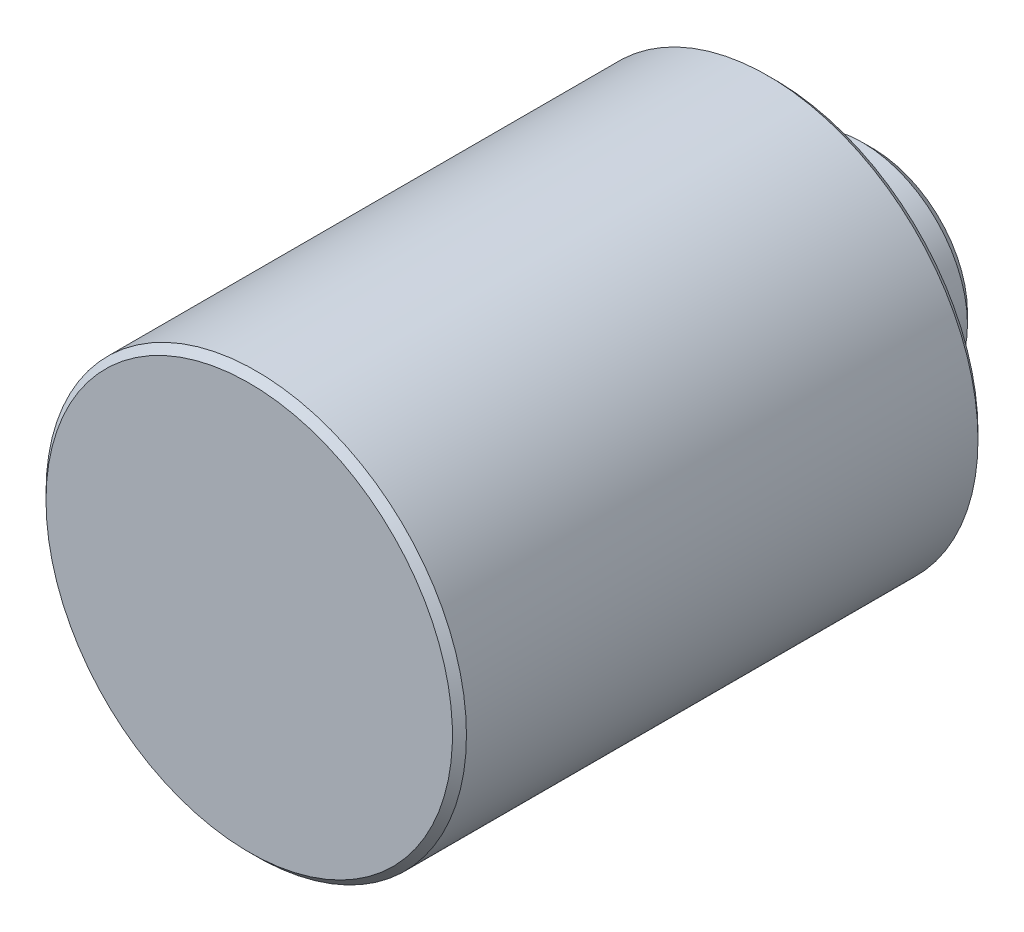
ISO-10303-21;
HEADER;
FILE_DESCRIPTION(('STEP AP214'),'2;1');
FILE_NAME('part.step','',(''),(''),'','','');
FILE_SCHEMA(('AUTOMOTIVE_DESIGN { 1 0 10303 214 1 1 1 1 }'));
ENDSEC;
DATA;
#1=APPLICATION_CONTEXT('core data for automotive mechanical design processes');
#2=APPLICATION_PROTOCOL_DEFINITION('international standard','automotive_design',2000,#1);
#3=PRODUCT_CONTEXT('',#1,'mechanical');
#4=PRODUCT('Part','Part','',(#3));
#5=PRODUCT_RELATED_PRODUCT_CATEGORY('part','',(#4));
#6=PRODUCT_DEFINITION_FORMATION('','',#4);
#7=PRODUCT_DEFINITION_CONTEXT('part definition',#1,'design');
#8=PRODUCT_DEFINITION('design','',#6,#7);
#9=PRODUCT_DEFINITION_SHAPE('','',#8);
#10=(LENGTH_UNIT() NAMED_UNIT(*) SI_UNIT(.MILLI.,.METRE.));
#11=(NAMED_UNIT(*) PLANE_ANGLE_UNIT() SI_UNIT($,.RADIAN.));
#12=(NAMED_UNIT(*) SI_UNIT($,.STERADIAN.) SOLID_ANGLE_UNIT());
#13=UNCERTAINTY_MEASURE_WITH_UNIT(LENGTH_MEASURE(1.E-05),#10,'distance_accuracy_value','');
#14=(GEOMETRIC_REPRESENTATION_CONTEXT(3) GLOBAL_UNCERTAINTY_ASSIGNED_CONTEXT((#13)) GLOBAL_UNIT_ASSIGNED_CONTEXT((#10,
#11,#12)) REPRESENTATION_CONTEXT('',''));
#15=CARTESIAN_POINT('',(0.,0.,0.));
#16=DIRECTION('',(0.,0.,1.));
#17=DIRECTION('',(1.,0.,0.));
#18=AXIS2_PLACEMENT_3D('',#15,#16,#17);
#19=CARTESIAN_POINT('',(0.,0.,6.20000000003529));
#20=DIRECTION('',(0.,0.,-1.));
#21=DIRECTION('',(-1.,0.,0.));
#22=AXIS2_PLACEMENT_3D('',#19,#20,#21);
#23=CONICAL_SURFACE('',#22,1.62100000005694,1.02974425868292);
#24=CARTESIAN_POINT('',(1.13686837721616E-10,0.,7.17399506345373));
#25=VERTEX_POINT('',#24);
#26=VERTEX_LOOP('',#25);
#27=FACE_BOUND('',#26,.T.);
#28=CARTESIAN_POINT('',(0.,0.,6.2));
#29=DIRECTION('',(0.,0.,-1.));
#30=DIRECTION('',(-1.,0.,0.));
#31=AXIS2_PLACEMENT_3D('',#28,#29,#30);
#32=CIRCLE('',#31,1.621);
#33=CARTESIAN_POINT('',(-1.621,0.,6.2));
#34=VERTEX_POINT('',#33);
#35=EDGE_CURVE('E33',#34,#34,#32,.T.);
#36=ORIENTED_EDGE('',*,*,#35,.T.);
#37=EDGE_LOOP('',(#36));
#38=FACE_BOUND('',#37,.T.);
#39=ADVANCED_FACE('F17',(#27,#38),#23,.F.);
#40=CARTESIAN_POINT('',(0.,0.,1.7));
#41=DIRECTION('',(0.,0.,-1.));
#42=DIRECTION('',(-1.,0.,0.));
#43=AXIS2_PLACEMENT_3D('',#40,#41,#42);
#44=CYLINDRICAL_SURFACE('',#43,1.621);
#45=ORIENTED_EDGE('',*,*,#35,.F.);
#46=EDGE_LOOP('',(#45));
#47=FACE_BOUND('',#46,.T.);
#48=CARTESIAN_POINT('',(0.,0.,-2.8));
#49=DIRECTION('',(0.,0.,-1.));
#50=DIRECTION('',(-1.,0.,0.));
#51=AXIS2_PLACEMENT_3D('',#48,#49,#50);
#52=CIRCLE('',#51,1.621);
#53=CARTESIAN_POINT('',(-1.621,0.,-2.8));
#54=VERTEX_POINT('',#53);
#55=EDGE_CURVE('E20',#54,#54,#52,.T.);
#56=ORIENTED_EDGE('',*,*,#55,.T.);
#57=EDGE_LOOP('',(#56));
#58=FACE_BOUND('',#57,.T.);
#59=ADVANCED_FACE('F30',(#47,#58),#44,.F.);
#60=CARTESIAN_POINT('',(0.,0.,-2.8));
#61=DIRECTION('',(0.,0.,1.));
#62=DIRECTION('',(1.,0.,0.));
#63=AXIS2_PLACEMENT_3D('',#60,#61,#62);
#64=PLANE('',#63);
#65=ORIENTED_EDGE('',*,*,#55,.F.);
#66=EDGE_LOOP('',(#65));
#67=FACE_BOUND('',#66,.T.);
#68=CARTESIAN_POINT('',(0.,0.,-2.79999999997926));
#69=DIRECTION('',(0.,0.,1.));
#70=DIRECTION('',(1.,0.,0.));
#71=AXIS2_PLACEMENT_3D('',#68,#69,#70);
#72=CIRCLE('',#71,2.70000000000437);
#73=CARTESIAN_POINT('',(2.70000000000437,0.,-2.79999999997926));
#74=VERTEX_POINT('',#73);
#75=EDGE_CURVE('E37',#74,#74,#72,.T.);
#76=ORIENTED_EDGE('',*,*,#75,.F.);
#77=EDGE_LOOP('',(#76));
#78=FACE_BOUND('',#77,.T.);
#79=ADVANCED_FACE('F60',(#67,#78),#64,.F.);
#80=CARTESIAN_POINT('',(0.,0.,-2.49999999994088));
#81=DIRECTION('',(0.,0.,1.));
#82=DIRECTION('',(1.,0.,0.));
#83=AXIS2_PLACEMENT_3D('',#80,#81,#82);
#84=CONICAL_SURFACE('',#83,3.00000000004275,0.785398163397448);
#85=CARTESIAN_POINT('',(0.,0.,-2.5));
#86=DIRECTION('',(0.,0.,-1.));
#87=DIRECTION('',(-1.,0.,0.));
#88=AXIS2_PLACEMENT_3D('',#85,#86,#87);
#89=CIRCLE('',#88,3.);
#90=CARTESIAN_POINT('',(-3.,0.,-2.5));
#91=VERTEX_POINT('',#90);
#92=EDGE_CURVE('E40',#91,#91,#89,.F.);
#93=ORIENTED_EDGE('',*,*,#92,.F.);
#94=EDGE_LOOP('',(#93));
#95=FACE_BOUND('',#94,.T.);
#96=ORIENTED_EDGE('',*,*,#75,.T.);
#97=EDGE_LOOP('',(#96));
#98=FACE_BOUND('',#97,.T.);
#99=ADVANCED_FACE('F58',(#95,#98),#84,.T.);
#100=CARTESIAN_POINT('',(0.,0.,0.));
#101=DIRECTION('',(0.,0.,-1.));
#102=DIRECTION('',(-1.,0.,0.));
#103=AXIS2_PLACEMENT_3D('',#100,#101,#102);
#104=CYLINDRICAL_SURFACE('',#103,3.);
#105=ORIENTED_EDGE('',*,*,#92,.T.);
#106=EDGE_LOOP('',(#105));
#107=FACE_BOUND('',#106,.T.);
#108=CARTESIAN_POINT('',(0.,0.,0.));
#109=DIRECTION('',(0.,0.,-1.));
#110=DIRECTION('',(-1.,0.,0.));
#111=AXIS2_PLACEMENT_3D('',#108,#109,#110);
#112=CIRCLE('',#111,3.);
#113=CARTESIAN_POINT('',(-3.,0.,0.));
#114=VERTEX_POINT('',#113);
#115=EDGE_CURVE('E47',#114,#114,#112,.F.);
#116=ORIENTED_EDGE('',*,*,#115,.F.);
#117=EDGE_LOOP('',(#116));
#118=FACE_BOUND('',#117,.T.);
#119=ADVANCED_FACE('F55',(#107,#118),#104,.T.);
#120=CARTESIAN_POINT('',(0.,0.,15.));
#121=DIRECTION('',(0.,0.,-1.));
#122=DIRECTION('',(-1.,0.,0.));
#123=AXIS2_PLACEMENT_3D('',#120,#121,#122);
#124=PLANE('',#123);
#125=CARTESIAN_POINT('',(0.,0.,15.0000000000432));
#126=DIRECTION('',(0.,0.,-1.));
#127=DIRECTION('',(-1.,0.,0.));
#128=AXIS2_PLACEMENT_3D('',#125,#126,#127);
#129=CIRCLE('',#128,5.80000000002201);
#130=CARTESIAN_POINT('',(-5.80000000002201,0.,15.0000000000432));
#131=VERTEX_POINT('',#130);
#132=EDGE_CURVE('E44',#131,#131,#129,.T.);
#133=ORIENTED_EDGE('',*,*,#132,.F.);
#134=EDGE_LOOP('',(#133));
#135=FACE_BOUND('',#134,.T.);
#136=ADVANCED_FACE('F67',(#135),#124,.F.);
#137=CARTESIAN_POINT('',(0.,0.,0.));
#138=DIRECTION('',(0.,0.,-1.));
#139=DIRECTION('',(-1.,0.,0.));
#140=AXIS2_PLACEMENT_3D('',#137,#138,#139);
#141=PLANE('',#140);
#142=ORIENTED_EDGE('',*,*,#115,.T.);
#143=EDGE_LOOP('',(#142));
#144=FACE_BOUND('',#143,.T.);
#145=CARTESIAN_POINT('',(0.,0.,-5.6843418860808E-11));
#146=DIRECTION('',(0.,0.,1.));
#147=DIRECTION('',(1.,0.,0.));
#148=AXIS2_PLACEMENT_3D('',#145,#146,#147);
#149=CIRCLE('',#148,5.80000000002201);
#150=CARTESIAN_POINT('',(5.80000000002201,0.,-5.6843418860808E-11));
#151=VERTEX_POINT('',#150);
#152=EDGE_CURVE('E41',#151,#151,#149,.T.);
#153=ORIENTED_EDGE('',*,*,#152,.F.);
#154=EDGE_LOOP('',(#153));
#155=FACE_BOUND('',#154,.T.);
#156=ADVANCED_FACE('F87',(#144,#155),#141,.T.);
#157=CARTESIAN_POINT('',(0.,0.,14.7999999999797));
#158=DIRECTION('',(0.,0.,-1.));
#159=DIRECTION('',(-1.,0.,0.));
#160=AXIS2_PLACEMENT_3D('',#157,#158,#159);
#161=CONICAL_SURFACE('',#160,6.00000000002865,0.78539816325534);
#162=CARTESIAN_POINT('',(0.,0.,14.8));
#163=DIRECTION('',(0.,0.,1.));
#164=DIRECTION('',(1.,0.,0.));
#165=AXIS2_PLACEMENT_3D('',#162,#163,#164);
#166=CIRCLE('',#165,6.);
#167=CARTESIAN_POINT('',(6.,0.,14.8));
#168=VERTEX_POINT('',#167);
#169=EDGE_CURVE('E24',#168,#168,#166,.F.);
#170=ORIENTED_EDGE('',*,*,#169,.F.);
#171=EDGE_LOOP('',(#170));
#172=FACE_BOUND('',#171,.T.);
#173=ORIENTED_EDGE('',*,*,#132,.T.);
#174=EDGE_LOOP('',(#173));
#175=FACE_BOUND('',#174,.T.);
#176=ADVANCED_FACE('F79',(#172,#175),#161,.T.);
#177=CARTESIAN_POINT('',(0.,0.,0.199999999495049));
#178=DIRECTION('',(0.,0.,1.));
#179=DIRECTION('',(1.,0.,0.));
#180=AXIS2_PLACEMENT_3D('',#177,#178,#179);
#181=CONICAL_SURFACE('',#180,5.9999999995739,0.785398163397448);
#182=ORIENTED_EDGE('',*,*,#152,.T.);
#183=EDGE_LOOP('',(#182));
#184=FACE_BOUND('',#183,.T.);
#185=CARTESIAN_POINT('',(0.,0.,0.199999999255));
#186=DIRECTION('',(0.,0.,1.));
#187=DIRECTION('',(1.,0.,0.));
#188=AXIS2_PLACEMENT_3D('',#185,#186,#187);
#189=CIRCLE('',#188,6.);
#190=CARTESIAN_POINT('',(6.,0.,0.199999999255));
#191=VERTEX_POINT('',#190);
#192=EDGE_CURVE('E11',#191,#191,#189,.T.);
#193=ORIENTED_EDGE('',*,*,#192,.F.);
#194=EDGE_LOOP('',(#193));
#195=FACE_BOUND('',#194,.T.);
#196=ADVANCED_FACE('F73',(#184,#195),#181,.T.);
#197=CARTESIAN_POINT('',(0.,0.,0.));
#198=DIRECTION('',(0.,0.,1.));
#199=DIRECTION('',(1.,0.,0.));
#200=AXIS2_PLACEMENT_3D('',#197,#198,#199);
#201=CYLINDRICAL_SURFACE('',#200,6.);
#202=ORIENTED_EDGE('',*,*,#169,.T.);
#203=EDGE_LOOP('',(#202));
#204=FACE_BOUND('',#203,.T.);
#205=ORIENTED_EDGE('',*,*,#192,.T.);
#206=EDGE_LOOP('',(#205));
#207=FACE_BOUND('',#206,.T.);
#208=ADVANCED_FACE('F71',(#204,#207),#201,.T.);
#209=CLOSED_SHELL('',(#39,#59,#79,#99,#119,#136,#156,#176,#196,#208));
#210=MANIFOLD_SOLID_BREP('B1',#209);
#211=ADVANCED_BREP_SHAPE_REPRESENTATION('',(#18,#210),#14);
#212=SHAPE_DEFINITION_REPRESENTATION(#9,#211);
ENDSEC;
END-ISO-10303-21;
